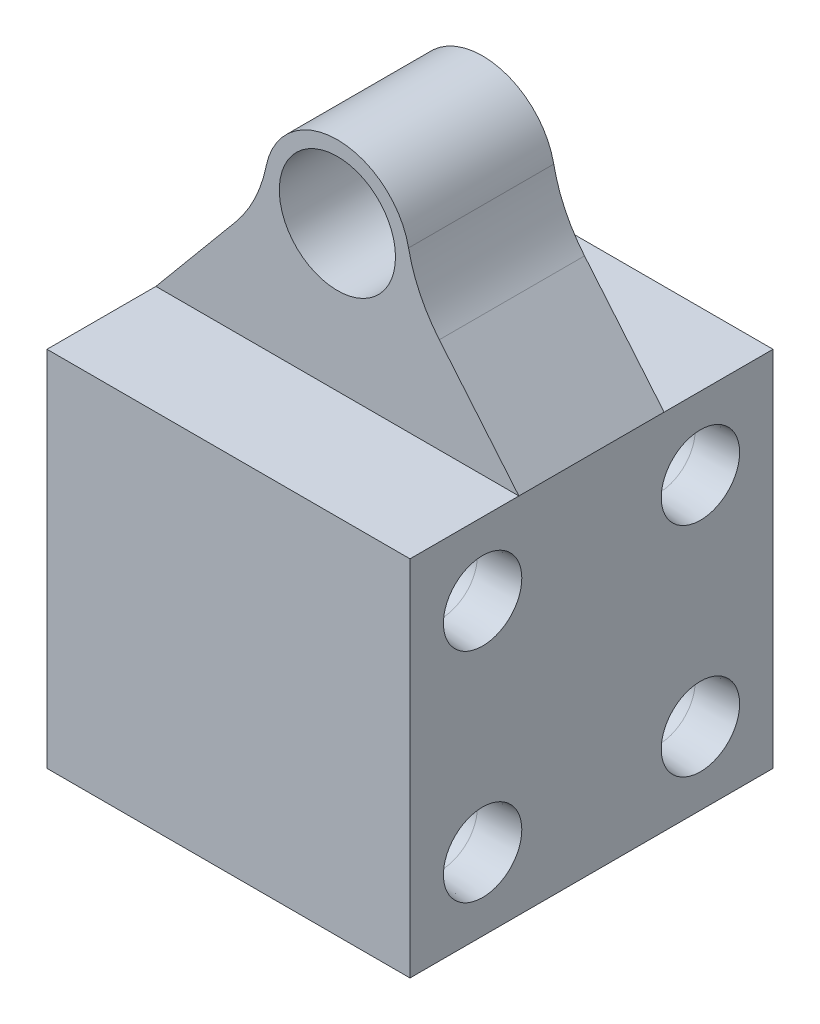
ISO-10303-21;
HEADER;
FILE_DESCRIPTION(('STEP AP214'),'2;1');
FILE_NAME('part.step','',(''),(''),'','','');
FILE_SCHEMA(('AUTOMOTIVE_DESIGN { 1 0 10303 214 1 1 1 1 }'));
ENDSEC;
DATA;
#1=APPLICATION_CONTEXT('core data for automotive mechanical design processes');
#2=APPLICATION_PROTOCOL_DEFINITION('international standard','automotive_design',2000,#1);
#3=PRODUCT_CONTEXT('',#1,'mechanical');
#4=PRODUCT('Part','Part','',(#3));
#5=PRODUCT_RELATED_PRODUCT_CATEGORY('part','',(#4));
#6=PRODUCT_DEFINITION_FORMATION('','',#4);
#7=PRODUCT_DEFINITION_CONTEXT('part definition',#1,'design');
#8=PRODUCT_DEFINITION('design','',#6,#7);
#9=PRODUCT_DEFINITION_SHAPE('','',#8);
#10=(LENGTH_UNIT() NAMED_UNIT(*) SI_UNIT(.MILLI.,.METRE.));
#11=(NAMED_UNIT(*) PLANE_ANGLE_UNIT() SI_UNIT($,.RADIAN.));
#12=(NAMED_UNIT(*) SI_UNIT($,.STERADIAN.) SOLID_ANGLE_UNIT());
#13=UNCERTAINTY_MEASURE_WITH_UNIT(LENGTH_MEASURE(1.E-05),#10,'distance_accuracy_value','');
#14=(GEOMETRIC_REPRESENTATION_CONTEXT(3) GLOBAL_UNCERTAINTY_ASSIGNED_CONTEXT((#13)) GLOBAL_UNIT_ASSIGNED_CONTEXT((#10,
#11,#12)) REPRESENTATION_CONTEXT('',''));
#15=CARTESIAN_POINT('',(0.,0.,0.));
#16=DIRECTION('',(0.,0.,1.));
#17=DIRECTION('',(1.,0.,0.));
#18=AXIS2_PLACEMENT_3D('',#15,#16,#17);
#19=CARTESIAN_POINT('',(0.,25.,0.));
#20=DIRECTION('',(0.,1.,0.));
#21=DIRECTION('',(0.,0.,1.));
#22=AXIS2_PLACEMENT_3D('',#19,#20,#21);
#23=PLANE('',#22);
#24=DIRECTION('',(0.,0.,1.));
#25=VECTOR('',#24,1.);
#26=CARTESIAN_POINT('',(-12.5,25.,-12.5));
#27=LINE('',#26,#25);
#28=CARTESIAN_POINT('',(-12.5,25.,-12.5));
#29=VERTEX_POINT('',#28);
#30=CARTESIAN_POINT('',(-12.5,25.,-5.));
#31=VERTEX_POINT('',#30);
#32=EDGE_CURVE('E248',#29,#31,#27,.T.);
#33=ORIENTED_EDGE('',*,*,#32,.T.);
#34=DIRECTION('',(1.,0.,0.));
#35=VECTOR('',#34,1.);
#36=CARTESIAN_POINT('',(0.,25.,-5.));
#37=LINE('',#36,#35);
#38=CARTESIAN_POINT('',(12.5,25.,-5.));
#39=VERTEX_POINT('',#38);
#40=EDGE_CURVE('E317',#31,#39,#37,.T.);
#41=ORIENTED_EDGE('',*,*,#40,.T.);
#42=DIRECTION('',(0.,0.,-1.));
#43=VECTOR('',#42,1.);
#44=CARTESIAN_POINT('',(12.5,25.,-12.5));
#45=LINE('',#44,#43);
#46=CARTESIAN_POINT('',(12.5,25.,-12.5));
#47=VERTEX_POINT('',#46);
#48=EDGE_CURVE('E267',#39,#47,#45,.T.);
#49=ORIENTED_EDGE('',*,*,#48,.T.);
#50=DIRECTION('',(-1.,0.,0.));
#51=VECTOR('',#50,1.);
#52=CARTESIAN_POINT('',(-12.5,25.,-12.5));
#53=LINE('',#52,#51);
#54=EDGE_CURVE('E249',#47,#29,#53,.T.);
#55=ORIENTED_EDGE('',*,*,#54,.T.);
#56=EDGE_LOOP('',(#33,#41,#49,#55));
#57=FACE_BOUND('',#56,.T.);
#58=ADVANCED_FACE('F107',(#57),#23,.T.);
#59=CARTESIAN_POINT('',(-12.5,5.,7.5));
#60=DIRECTION('',(-1.,0.,0.));
#61=DIRECTION('',(0.,0.,1.));
#62=AXIS2_PLACEMENT_3D('',#59,#60,#61);
#63=CONICAL_SURFACE('',#62,2.7,0.0698131700797731);
#64=CARTESIAN_POINT('',(-9.63986674865748,5.,7.5));
#65=DIRECTION('',(-1.,0.,0.));
#66=DIRECTION('',(0.,0.,1.));
#67=AXIS2_PLACEMENT_3D('',#64,#65,#66);
#68=CIRCLE('',#67,2.49999999999999);
#69=CARTESIAN_POINT('',(-9.63986674865748,5.,9.99999999999999));
#70=VERTEX_POINT('',#69);
#71=EDGE_CURVE('E292',#70,#70,#68,.T.);
#72=ORIENTED_EDGE('',*,*,#71,.F.);
#73=EDGE_LOOP('',(#72));
#74=FACE_BOUND('',#73,.T.);
#75=CARTESIAN_POINT('',(-12.5,5.,7.5));
#76=DIRECTION('',(-1.,0.,0.));
#77=DIRECTION('',(0.,0.,1.));
#78=AXIS2_PLACEMENT_3D('',#75,#76,#77);
#79=CIRCLE('',#78,2.7);
#80=CARTESIAN_POINT('',(-12.5,5.,10.2));
#81=VERTEX_POINT('',#80);
#82=EDGE_CURVE('E286',#81,#81,#79,.T.);
#83=ORIENTED_EDGE('',*,*,#82,.T.);
#84=EDGE_LOOP('',(#83));
#85=FACE_BOUND('',#84,.T.);
#86=ADVANCED_FACE('F405',(#74,#85),#63,.F.);
#87=CARTESIAN_POINT('',(-12.5,5.,7.5));
#88=DIRECTION('',(-1.,0.,0.));
#89=DIRECTION('',(0.,0.,1.));
#90=AXIS2_PLACEMENT_3D('',#87,#88,#89);
#91=CYLINDRICAL_SURFACE('',#90,2.49999999999999);
#92=CARTESIAN_POINT('',(-2.5,5.,7.5));
#93=DIRECTION('',(-1.,0.,0.));
#94=DIRECTION('',(0.,0.,1.));
#95=AXIS2_PLACEMENT_3D('',#92,#93,#94);
#96=CIRCLE('',#95,2.49999999999999);
#97=CARTESIAN_POINT('',(-2.5,5.,9.99999999999999));
#98=VERTEX_POINT('',#97);
#99=EDGE_CURVE('E289',#98,#98,#96,.T.);
#100=ORIENTED_EDGE('',*,*,#99,.F.);
#101=EDGE_LOOP('',(#100));
#102=FACE_BOUND('',#101,.T.);
#103=ORIENTED_EDGE('',*,*,#71,.T.);
#104=EDGE_LOOP('',(#103));
#105=FACE_BOUND('',#104,.T.);
#106=ADVANCED_FACE('F411',(#102,#105),#91,.F.);
#107=CARTESIAN_POINT('',(-2.5,5.,7.5));
#108=DIRECTION('',(-1.,0.,0.));
#109=DIRECTION('',(0.,0.,1.));
#110=AXIS2_PLACEMENT_3D('',#107,#108,#109);
#111=CONICAL_SURFACE('',#110,2.49999999999999,1.02974425867665);
#112=CARTESIAN_POINT('',(-0.997848452431096,5.,7.5));
#113=VERTEX_POINT('',#112);
#114=VERTEX_LOOP('',#113);
#115=FACE_BOUND('',#114,.T.);
#116=ORIENTED_EDGE('',*,*,#99,.T.);
#117=EDGE_LOOP('',(#116));
#118=FACE_BOUND('',#117,.T.);
#119=ADVANCED_FACE('F539',(#115,#118),#111,.F.);
#120=CARTESIAN_POINT('',(-12.5,20.,7.5));
#121=DIRECTION('',(-1.,0.,0.));
#122=DIRECTION('',(0.,0.,1.));
#123=AXIS2_PLACEMENT_3D('',#120,#121,#122);
#124=CONICAL_SURFACE('',#123,2.7,0.0698131700797731);
#125=CARTESIAN_POINT('',(-9.63986674865748,20.,7.5));
#126=DIRECTION('',(-1.,0.,0.));
#127=DIRECTION('',(0.,0.,1.));
#128=AXIS2_PLACEMENT_3D('',#125,#126,#127);
#129=CIRCLE('',#128,2.49999999999999);
#130=CARTESIAN_POINT('',(-9.63986674865748,20.,9.99999999999999));
#131=VERTEX_POINT('',#130);
#132=EDGE_CURVE('E283',#131,#131,#129,.T.);
#133=ORIENTED_EDGE('',*,*,#132,.F.);
#134=EDGE_LOOP('',(#133));
#135=FACE_BOUND('',#134,.T.);
#136=CARTESIAN_POINT('',(-12.5,20.,7.5));
#137=DIRECTION('',(-1.,0.,0.));
#138=DIRECTION('',(0.,0.,1.));
#139=AXIS2_PLACEMENT_3D('',#136,#137,#138);
#140=CIRCLE('',#139,2.7);
#141=CARTESIAN_POINT('',(-12.5,20.,10.2));
#142=VERTEX_POINT('',#141);
#143=EDGE_CURVE('E277',#142,#142,#140,.T.);
#144=ORIENTED_EDGE('',*,*,#143,.T.);
#145=EDGE_LOOP('',(#144));
#146=FACE_BOUND('',#145,.T.);
#147=ADVANCED_FACE('F543',(#135,#146),#124,.F.);
#148=CARTESIAN_POINT('',(-12.5,20.,7.5));
#149=DIRECTION('',(-1.,0.,0.));
#150=DIRECTION('',(0.,0.,1.));
#151=AXIS2_PLACEMENT_3D('',#148,#149,#150);
#152=CYLINDRICAL_SURFACE('',#151,2.49999999999999);
#153=CARTESIAN_POINT('',(-2.5,20.,7.5));
#154=DIRECTION('',(-1.,0.,0.));
#155=DIRECTION('',(0.,0.,1.));
#156=AXIS2_PLACEMENT_3D('',#153,#154,#155);
#157=CIRCLE('',#156,2.49999999999999);
#158=CARTESIAN_POINT('',(-2.5,20.,9.99999999999999));
#159=VERTEX_POINT('',#158);
#160=EDGE_CURVE('E280',#159,#159,#157,.T.);
#161=ORIENTED_EDGE('',*,*,#160,.F.);
#162=EDGE_LOOP('',(#161));
#163=FACE_BOUND('',#162,.T.);
#164=ORIENTED_EDGE('',*,*,#132,.T.);
#165=EDGE_LOOP('',(#164));
#166=FACE_BOUND('',#165,.T.);
#167=ADVANCED_FACE('F547',(#163,#166),#152,.F.);
#168=CARTESIAN_POINT('',(-2.5,20.,7.5));
#169=DIRECTION('',(-1.,0.,0.));
#170=DIRECTION('',(0.,0.,1.));
#171=AXIS2_PLACEMENT_3D('',#168,#169,#170);
#172=CONICAL_SURFACE('',#171,2.49999999999999,1.02974425867665);
#173=CARTESIAN_POINT('',(-0.997848452431096,20.,7.5));
#174=VERTEX_POINT('',#173);
#175=VERTEX_LOOP('',#174);
#176=FACE_BOUND('',#175,.T.);
#177=ORIENTED_EDGE('',*,*,#160,.T.);
#178=EDGE_LOOP('',(#177));
#179=FACE_BOUND('',#178,.T.);
#180=ADVANCED_FACE('F551',(#176,#179),#172,.F.);
#181=CARTESIAN_POINT('',(12.5,25.,-12.5));
#182=DIRECTION('',(-1.,0.,0.));
#183=DIRECTION('',(0.,0.,1.));
#184=AXIS2_PLACEMENT_3D('',#181,#182,#183);
#185=PLANE('',#184);
#186=CARTESIAN_POINT('',(12.5,5.,7.5));
#187=DIRECTION('',(1.,0.,0.));
#188=DIRECTION('',(0.,0.,-1.));
#189=AXIS2_PLACEMENT_3D('',#186,#187,#188);
#190=CIRCLE('',#189,2.7);
#191=CARTESIAN_POINT('',(12.5,5.,4.8));
#192=VERTEX_POINT('',#191);
#193=EDGE_CURVE('E322',#192,#192,#190,.T.);
#194=ORIENTED_EDGE('',*,*,#193,.F.);
#195=EDGE_LOOP('',(#194));
#196=FACE_BOUND('',#195,.T.);
#197=CARTESIAN_POINT('',(12.5,5.,-7.5));
#198=DIRECTION('',(1.,0.,0.));
#199=DIRECTION('',(0.,0.,-1.));
#200=AXIS2_PLACEMENT_3D('',#197,#198,#199);
#201=CIRCLE('',#200,2.7);
#202=CARTESIAN_POINT('',(12.5,5.,-10.2));
#203=VERTEX_POINT('',#202);
#204=EDGE_CURVE('E332',#203,#203,#201,.T.);
#205=ORIENTED_EDGE('',*,*,#204,.F.);
#206=EDGE_LOOP('',(#205));
#207=FACE_BOUND('',#206,.T.);
#208=CARTESIAN_POINT('',(12.5,20.,7.5));
#209=DIRECTION('',(1.,0.,0.));
#210=DIRECTION('',(0.,0.,-1.));
#211=AXIS2_PLACEMENT_3D('',#208,#209,#210);
#212=CIRCLE('',#211,2.7);
#213=CARTESIAN_POINT('',(12.5,20.,4.8));
#214=VERTEX_POINT('',#213);
#215=EDGE_CURVE('E341',#214,#214,#212,.T.);
#216=ORIENTED_EDGE('',*,*,#215,.F.);
#217=EDGE_LOOP('',(#216));
#218=FACE_BOUND('',#217,.T.);
#219=CARTESIAN_POINT('',(12.5,20.,-7.5));
#220=DIRECTION('',(1.,0.,0.));
#221=DIRECTION('',(0.,0.,-1.));
#222=AXIS2_PLACEMENT_3D('',#219,#220,#221);
#223=CIRCLE('',#222,2.7);
#224=CARTESIAN_POINT('',(12.5,20.,-10.2));
#225=VERTEX_POINT('',#224);
#226=EDGE_CURVE('E350',#225,#225,#223,.T.);
#227=ORIENTED_EDGE('',*,*,#226,.F.);
#228=EDGE_LOOP('',(#227));
#229=FACE_BOUND('',#228,.T.);
#230=DIRECTION('',(0.,0.,-1.));
#231=VECTOR('',#230,1.);
#232=CARTESIAN_POINT('',(12.5,0.,-12.5));
#233=LINE('',#232,#231);
#234=CARTESIAN_POINT('',(12.5,0.,12.5));
#235=VERTEX_POINT('',#234);
#236=CARTESIAN_POINT('',(12.5,0.,-12.5));
#237=VERTEX_POINT('',#236);
#238=EDGE_CURVE('E257',#235,#237,#233,.T.);
#239=ORIENTED_EDGE('',*,*,#238,.T.);
#240=DIRECTION('',(0.,-1.,0.));
#241=VECTOR('',#240,1.);
#242=CARTESIAN_POINT('',(12.5,25.,-12.5));
#243=LINE('',#242,#241);
#244=EDGE_CURVE('E274',#47,#237,#243,.T.);
#245=ORIENTED_EDGE('',*,*,#244,.F.);
#246=ORIENTED_EDGE('',*,*,#48,.F.);
#247=DIRECTION('',(0.,0.,1.));
#248=VECTOR('',#247,1.);
#249=CARTESIAN_POINT('',(12.5,25.,-5.));
#250=LINE('',#249,#248);
#251=CARTESIAN_POINT('',(12.5,25.,5.));
#252=VERTEX_POINT('',#251);
#253=EDGE_CURVE('E231',#39,#252,#250,.T.);
#254=ORIENTED_EDGE('',*,*,#253,.T.);
#255=CARTESIAN_POINT('',(12.5,25.,12.5));
#256=VERTEX_POINT('',#255);
#257=EDGE_CURVE('E240',#256,#252,#45,.T.);
#258=ORIENTED_EDGE('',*,*,#257,.F.);
#259=DIRECTION('',(0.,-1.,0.));
#260=VECTOR('',#259,1.);
#261=CARTESIAN_POINT('',(12.5,25.,12.5));
#262=LINE('',#261,#260);
#263=EDGE_CURVE('E256',#256,#235,#262,.T.);
#264=ORIENTED_EDGE('',*,*,#263,.T.);
#265=EDGE_LOOP('',(#239,#245,#246,#254,#258,#264));
#266=FACE_BOUND('',#265,.T.);
#267=ADVANCED_FACE('F383',(#196,#207,#218,#229,#266),#185,.F.);
#268=CARTESIAN_POINT('',(-12.5,25.,-12.5));
#269=DIRECTION('',(0.,0.,1.));
#270=DIRECTION('',(1.,0.,0.));
#271=AXIS2_PLACEMENT_3D('',#268,#269,#270);
#272=PLANE('',#271);
#273=DIRECTION('',(-1.,0.,0.));
#274=VECTOR('',#273,1.);
#275=CARTESIAN_POINT('',(-12.5,0.,-12.5));
#276=LINE('',#275,#274);
#277=CARTESIAN_POINT('',(-12.5,0.,-12.5));
#278=VERTEX_POINT('',#277);
#279=EDGE_CURVE('E260',#237,#278,#276,.T.);
#280=ORIENTED_EDGE('',*,*,#279,.T.);
#281=DIRECTION('',(0.,-1.,0.));
#282=VECTOR('',#281,1.);
#283=CARTESIAN_POINT('',(-12.5,25.,-12.5));
#284=LINE('',#283,#282);
#285=EDGE_CURVE('E271',#29,#278,#284,.T.);
#286=ORIENTED_EDGE('',*,*,#285,.F.);
#287=ORIENTED_EDGE('',*,*,#54,.F.);
#288=ORIENTED_EDGE('',*,*,#244,.T.);
#289=EDGE_LOOP('',(#280,#286,#287,#288));
#290=FACE_BOUND('',#289,.T.);
#291=ADVANCED_FACE('F382',(#290),#272,.F.);
#292=CARTESIAN_POINT('',(-12.5,25.,-12.5));
#293=DIRECTION('',(1.,0.,0.));
#294=DIRECTION('',(0.,0.,-1.));
#295=AXIS2_PLACEMENT_3D('',#292,#293,#294);
#296=PLANE('',#295);
#297=CARTESIAN_POINT('',(-12.5,5.,-7.5));
#298=DIRECTION('',(-1.,0.,0.));
#299=DIRECTION('',(0.,0.,1.));
#300=AXIS2_PLACEMENT_3D('',#297,#298,#299);
#301=CIRCLE('',#300,2.7);
#302=CARTESIAN_POINT('',(-12.5,5.,-4.8));
#303=VERTEX_POINT('',#302);
#304=EDGE_CURVE('E359',#303,#303,#301,.T.);
#305=ORIENTED_EDGE('',*,*,#304,.F.);
#306=EDGE_LOOP('',(#305));
#307=FACE_BOUND('',#306,.T.);
#308=CARTESIAN_POINT('',(-12.5,20.,-7.5));
#309=DIRECTION('',(-1.,0.,0.));
#310=DIRECTION('',(0.,0.,1.));
#311=AXIS2_PLACEMENT_3D('',#308,#309,#310);
#312=CIRCLE('',#311,2.7);
#313=CARTESIAN_POINT('',(-12.5,20.,-4.8));
#314=VERTEX_POINT('',#313);
#315=EDGE_CURVE('E368',#314,#314,#312,.T.);
#316=ORIENTED_EDGE('',*,*,#315,.F.);
#317=EDGE_LOOP('',(#316));
#318=FACE_BOUND('',#317,.T.);
#319=DIRECTION('',(0.,0.,1.));
#320=VECTOR('',#319,1.);
#321=CARTESIAN_POINT('',(-12.5,0.,-12.5));
#322=LINE('',#321,#320);
#323=CARTESIAN_POINT('',(-12.5,0.,12.5));
#324=VERTEX_POINT('',#323);
#325=EDGE_CURVE('E263',#278,#324,#322,.T.);
#326=ORIENTED_EDGE('',*,*,#325,.T.);
#327=DIRECTION('',(0.,-1.,0.));
#328=VECTOR('',#327,1.);
#329=CARTESIAN_POINT('',(-12.5,25.,12.5));
#330=LINE('',#329,#328);
#331=CARTESIAN_POINT('',(-12.5,25.,12.5));
#332=VERTEX_POINT('',#331);
#333=EDGE_CURVE('E246',#332,#324,#330,.T.);
#334=ORIENTED_EDGE('',*,*,#333,.F.);
#335=CARTESIAN_POINT('',(-12.5,25.,5.));
#336=VERTEX_POINT('',#335);
#337=EDGE_CURVE('E237',#336,#332,#27,.T.);
#338=ORIENTED_EDGE('',*,*,#337,.F.);
#339=DIRECTION('',(0.,0.,1.));
#340=VECTOR('',#339,1.);
#341=CARTESIAN_POINT('',(-12.5,25.,-5.));
#342=LINE('',#341,#340);
#343=EDGE_CURVE('E222',#31,#336,#342,.T.);
#344=ORIENTED_EDGE('',*,*,#343,.F.);
#345=ORIENTED_EDGE('',*,*,#32,.F.);
#346=ORIENTED_EDGE('',*,*,#285,.T.);
#347=EDGE_LOOP('',(#326,#334,#338,#344,#345,#346));
#348=FACE_BOUND('',#347,.T.);
#349=ORIENTED_EDGE('',*,*,#143,.F.);
#350=EDGE_LOOP('',(#349));
#351=FACE_BOUND('',#350,.T.);
#352=ORIENTED_EDGE('',*,*,#82,.F.);
#353=EDGE_LOOP('',(#352));
#354=FACE_BOUND('',#353,.T.);
#355=ADVANCED_FACE('F243',(#307,#318,#348,#351,#354),#296,.F.);
#356=CARTESIAN_POINT('',(-12.5,25.,12.5));
#357=DIRECTION('',(0.,0.,-1.));
#358=DIRECTION('',(-1.,0.,0.));
#359=AXIS2_PLACEMENT_3D('',#356,#357,#358);
#360=PLANE('',#359);
#361=DIRECTION('',(1.,0.,0.));
#362=VECTOR('',#361,1.);
#363=CARTESIAN_POINT('',(-12.5,0.,12.5));
#364=LINE('',#363,#362);
#365=EDGE_CURVE('E265',#324,#235,#364,.T.);
#366=ORIENTED_EDGE('',*,*,#365,.T.);
#367=ORIENTED_EDGE('',*,*,#263,.F.);
#368=DIRECTION('',(1.,0.,0.));
#369=VECTOR('',#368,1.);
#370=CARTESIAN_POINT('',(-12.5,25.,12.5));
#371=LINE('',#370,#369);
#372=EDGE_CURVE('E251',#332,#256,#371,.T.);
#373=ORIENTED_EDGE('',*,*,#372,.F.);
#374=ORIENTED_EDGE('',*,*,#333,.T.);
#375=EDGE_LOOP('',(#366,#367,#373,#374));
#376=FACE_BOUND('',#375,.T.);
#377=ADVANCED_FACE('F391',(#376),#360,.F.);
#378=DIRECTION('',(1.,0.,0.));
#379=VECTOR('',#378,1.);
#380=CARTESIAN_POINT('',(0.,25.,5.));
#381=LINE('',#380,#379);
#382=EDGE_CURVE('E213',#336,#252,#381,.T.);
#383=ORIENTED_EDGE('',*,*,#382,.F.);
#384=ORIENTED_EDGE('',*,*,#337,.T.);
#385=ORIENTED_EDGE('',*,*,#372,.T.);
#386=ORIENTED_EDGE('',*,*,#257,.T.);
#387=EDGE_LOOP('',(#383,#384,#385,#386));
#388=FACE_BOUND('',#387,.T.);
#389=ADVANCED_FACE('F236',(#388),#23,.T.);
#390=CARTESIAN_POINT('',(0.,0.,0.));
#391=DIRECTION('',(0.,1.,0.));
#392=DIRECTION('',(0.,0.,1.));
#393=AXIS2_PLACEMENT_3D('',#390,#391,#392);
#394=PLANE('',#393);
#395=ORIENTED_EDGE('',*,*,#238,.F.);
#396=ORIENTED_EDGE('',*,*,#365,.F.);
#397=ORIENTED_EDGE('',*,*,#325,.F.);
#398=ORIENTED_EDGE('',*,*,#279,.F.);
#399=EDGE_LOOP('',(#395,#396,#397,#398));
#400=FACE_BOUND('',#399,.T.);
#401=ADVANCED_FACE('F388',(#400),#394,.F.);
#402=CARTESIAN_POINT('',(-2.50000000000001,20.,-7.5));
#403=DIRECTION('',(-1.,0.,0.));
#404=DIRECTION('',(0.,0.,1.));
#405=AXIS2_PLACEMENT_3D('',#402,#403,#404);
#406=CONICAL_SURFACE('',#405,2.49999999999999,1.02974425867665);
#407=CARTESIAN_POINT('',(-0.997848452431099,20.,-7.5));
#408=VERTEX_POINT('',#407);
#409=VERTEX_LOOP('',#408);
#410=FACE_BOUND('',#409,.T.);
#411=CARTESIAN_POINT('',(-2.50000000000001,20.,-7.5));
#412=DIRECTION('',(-1.,0.,0.));
#413=DIRECTION('',(0.,0.,1.));
#414=AXIS2_PLACEMENT_3D('',#411,#412,#413);
#415=CIRCLE('',#414,2.49999999999999);
#416=CARTESIAN_POINT('',(-2.50000000000001,20.,-5.00000000000001));
#417=VERTEX_POINT('',#416);
#418=EDGE_CURVE('E261',#417,#417,#415,.T.);
#419=ORIENTED_EDGE('',*,*,#418,.T.);
#420=EDGE_LOOP('',(#419));
#421=FACE_BOUND('',#420,.T.);
#422=ADVANCED_FACE('F415',(#410,#421),#406,.F.);
#423=CARTESIAN_POINT('',(-12.5,20.,-7.5));
#424=DIRECTION('',(-1.,0.,0.));
#425=DIRECTION('',(0.,0.,1.));
#426=AXIS2_PLACEMENT_3D('',#423,#424,#425);
#427=CYLINDRICAL_SURFACE('',#426,2.49999999999999);
#428=ORIENTED_EDGE('',*,*,#418,.F.);
#429=EDGE_LOOP('',(#428));
#430=FACE_BOUND('',#429,.T.);
#431=CARTESIAN_POINT('',(-9.63986674865748,20.,-7.5));
#432=DIRECTION('',(-1.,0.,0.));
#433=DIRECTION('',(0.,0.,1.));
#434=AXIS2_PLACEMENT_3D('',#431,#432,#433);
#435=CIRCLE('',#434,2.49999999999999);
#436=CARTESIAN_POINT('',(-9.63986674865748,20.,-5.00000000000001));
#437=VERTEX_POINT('',#436);
#438=EDGE_CURVE('E371',#437,#437,#435,.T.);
#439=ORIENTED_EDGE('',*,*,#438,.T.);
#440=EDGE_LOOP('',(#439));
#441=FACE_BOUND('',#440,.T.);
#442=ADVANCED_FACE('F421',(#430,#441),#427,.F.);
#443=CARTESIAN_POINT('',(-12.5,20.,-7.5));
#444=DIRECTION('',(-1.,0.,0.));
#445=DIRECTION('',(0.,0.,1.));
#446=AXIS2_PLACEMENT_3D('',#443,#444,#445);
#447=CONICAL_SURFACE('',#446,2.7,0.0698131700797731);
#448=ORIENTED_EDGE('',*,*,#438,.F.);
#449=EDGE_LOOP('',(#448));
#450=FACE_BOUND('',#449,.T.);
#451=ORIENTED_EDGE('',*,*,#315,.T.);
#452=EDGE_LOOP('',(#451));
#453=FACE_BOUND('',#452,.T.);
#454=ADVANCED_FACE('F426',(#450,#453),#447,.F.);
#455=CARTESIAN_POINT('',(-2.50000000000001,5.,-7.5));
#456=DIRECTION('',(-1.,0.,0.));
#457=DIRECTION('',(0.,0.,1.));
#458=AXIS2_PLACEMENT_3D('',#455,#456,#457);
#459=CONICAL_SURFACE('',#458,2.49999999999999,1.02974425867665);
#460=CARTESIAN_POINT('',(-0.997848452431099,5.,-7.5));
#461=VERTEX_POINT('',#460);
#462=VERTEX_LOOP('',#461);
#463=FACE_BOUND('',#462,.T.);
#464=CARTESIAN_POINT('',(-2.50000000000001,5.,-7.5));
#465=DIRECTION('',(-1.,0.,0.));
#466=DIRECTION('',(0.,0.,1.));
#467=AXIS2_PLACEMENT_3D('',#464,#465,#466);
#468=CIRCLE('',#467,2.49999999999999);
#469=CARTESIAN_POINT('',(-2.50000000000001,5.,-5.00000000000001));
#470=VERTEX_POINT('',#469);
#471=EDGE_CURVE('E365',#470,#470,#468,.T.);
#472=ORIENTED_EDGE('',*,*,#471,.T.);
#473=EDGE_LOOP('',(#472));
#474=FACE_BOUND('',#473,.T.);
#475=ADVANCED_FACE('F435',(#463,#474),#459,.F.);
#476=CARTESIAN_POINT('',(-12.5,5.,-7.5));
#477=DIRECTION('',(-1.,0.,0.));
#478=DIRECTION('',(0.,0.,1.));
#479=AXIS2_PLACEMENT_3D('',#476,#477,#478);
#480=CYLINDRICAL_SURFACE('',#479,2.49999999999999);
#481=ORIENTED_EDGE('',*,*,#471,.F.);
#482=EDGE_LOOP('',(#481));
#483=FACE_BOUND('',#482,.T.);
#484=CARTESIAN_POINT('',(-9.63986674865748,5.,-7.5));
#485=DIRECTION('',(-1.,0.,0.));
#486=DIRECTION('',(0.,0.,1.));
#487=AXIS2_PLACEMENT_3D('',#484,#485,#486);
#488=CIRCLE('',#487,2.49999999999999);
#489=CARTESIAN_POINT('',(-9.63986674865748,5.,-5.00000000000001));
#490=VERTEX_POINT('',#489);
#491=EDGE_CURVE('E362',#490,#490,#488,.T.);
#492=ORIENTED_EDGE('',*,*,#491,.T.);
#493=EDGE_LOOP('',(#492));
#494=FACE_BOUND('',#493,.T.);
#495=ADVANCED_FACE('F442',(#483,#494),#480,.F.);
#496=CARTESIAN_POINT('',(-12.5,5.,-7.5));
#497=DIRECTION('',(-1.,0.,0.));
#498=DIRECTION('',(0.,0.,1.));
#499=AXIS2_PLACEMENT_3D('',#496,#497,#498);
#500=CONICAL_SURFACE('',#499,2.7,0.0698131700797731);
#501=ORIENTED_EDGE('',*,*,#491,.F.);
#502=EDGE_LOOP('',(#501));
#503=FACE_BOUND('',#502,.T.);
#504=ORIENTED_EDGE('',*,*,#304,.T.);
#505=EDGE_LOOP('',(#504));
#506=FACE_BOUND('',#505,.T.);
#507=ADVANCED_FACE('F448',(#503,#506),#500,.F.);
#508=CARTESIAN_POINT('',(2.50000000000001,20.,-7.5));
#509=DIRECTION('',(1.,0.,0.));
#510=DIRECTION('',(0.,0.,-1.));
#511=AXIS2_PLACEMENT_3D('',#508,#509,#510);
#512=CONICAL_SURFACE('',#511,2.49999999999999,1.02974425867665);
#513=CARTESIAN_POINT('',(0.997848452431099,20.,-7.5));
#514=VERTEX_POINT('',#513);
#515=VERTEX_LOOP('',#514);
#516=FACE_BOUND('',#515,.T.);
#517=CARTESIAN_POINT('',(2.50000000000001,20.,-7.5));
#518=DIRECTION('',(1.,0.,0.));
#519=DIRECTION('',(0.,0.,-1.));
#520=AXIS2_PLACEMENT_3D('',#517,#518,#519);
#521=CIRCLE('',#520,2.49999999999999);
#522=CARTESIAN_POINT('',(2.50000000000001,20.,-9.99999999999999));
#523=VERTEX_POINT('',#522);
#524=EDGE_CURVE('E356',#523,#523,#521,.T.);
#525=ORIENTED_EDGE('',*,*,#524,.T.);
#526=EDGE_LOOP('',(#525));
#527=FACE_BOUND('',#526,.T.);
#528=ADVANCED_FACE('F452',(#516,#527),#512,.F.);
#529=CARTESIAN_POINT('',(12.5,20.,-7.5));
#530=DIRECTION('',(1.,0.,0.));
#531=DIRECTION('',(0.,0.,-1.));
#532=AXIS2_PLACEMENT_3D('',#529,#530,#531);
#533=CYLINDRICAL_SURFACE('',#532,2.49999999999999);
#534=ORIENTED_EDGE('',*,*,#524,.F.);
#535=EDGE_LOOP('',(#534));
#536=FACE_BOUND('',#535,.T.);
#537=CARTESIAN_POINT('',(9.63986674865748,20.,-7.5));
#538=DIRECTION('',(1.,0.,0.));
#539=DIRECTION('',(0.,0.,-1.));
#540=AXIS2_PLACEMENT_3D('',#537,#538,#539);
#541=CIRCLE('',#540,2.49999999999999);
#542=CARTESIAN_POINT('',(9.63986674865748,20.,-9.99999999999999));
#543=VERTEX_POINT('',#542);
#544=EDGE_CURVE('E353',#543,#543,#541,.T.);
#545=ORIENTED_EDGE('',*,*,#544,.T.);
#546=EDGE_LOOP('',(#545));
#547=FACE_BOUND('',#546,.T.);
#548=ADVANCED_FACE('F456',(#536,#547),#533,.F.);
#549=CARTESIAN_POINT('',(12.5,20.,-7.5));
#550=DIRECTION('',(1.,0.,0.));
#551=DIRECTION('',(0.,0.,-1.));
#552=AXIS2_PLACEMENT_3D('',#549,#550,#551);
#553=CONICAL_SURFACE('',#552,2.7,0.0698131700797731);
#554=ORIENTED_EDGE('',*,*,#544,.F.);
#555=EDGE_LOOP('',(#554));
#556=FACE_BOUND('',#555,.T.);
#557=ORIENTED_EDGE('',*,*,#226,.T.);
#558=EDGE_LOOP('',(#557));
#559=FACE_BOUND('',#558,.T.);
#560=ADVANCED_FACE('F460',(#556,#559),#553,.F.);
#561=CARTESIAN_POINT('',(2.5,20.,7.5));
#562=DIRECTION('',(1.,0.,0.));
#563=DIRECTION('',(0.,0.,-1.));
#564=AXIS2_PLACEMENT_3D('',#561,#562,#563);
#565=CONICAL_SURFACE('',#564,2.49999999999999,1.02974425867665);
#566=CARTESIAN_POINT('',(0.997848452431097,20.,7.5));
#567=VERTEX_POINT('',#566);
#568=VERTEX_LOOP('',#567);
#569=FACE_BOUND('',#568,.T.);
#570=CARTESIAN_POINT('',(2.5,20.,7.5));
#571=DIRECTION('',(1.,0.,0.));
#572=DIRECTION('',(0.,0.,-1.));
#573=AXIS2_PLACEMENT_3D('',#570,#571,#572);
#574=CIRCLE('',#573,2.49999999999999);
#575=CARTESIAN_POINT('',(2.5,20.,5.00000000000001));
#576=VERTEX_POINT('',#575);
#577=EDGE_CURVE('E347',#576,#576,#574,.T.);
#578=ORIENTED_EDGE('',*,*,#577,.T.);
#579=EDGE_LOOP('',(#578));
#580=FACE_BOUND('',#579,.T.);
#581=ADVANCED_FACE('F464',(#569,#580),#565,.F.);
#582=CARTESIAN_POINT('',(12.5,20.,7.5));
#583=DIRECTION('',(1.,0.,0.));
#584=DIRECTION('',(0.,0.,-1.));
#585=AXIS2_PLACEMENT_3D('',#582,#583,#584);
#586=CYLINDRICAL_SURFACE('',#585,2.49999999999999);
#587=ORIENTED_EDGE('',*,*,#577,.F.);
#588=EDGE_LOOP('',(#587));
#589=FACE_BOUND('',#588,.T.);
#590=CARTESIAN_POINT('',(9.63986674865748,20.,7.5));
#591=DIRECTION('',(1.,0.,0.));
#592=DIRECTION('',(0.,0.,-1.));
#593=AXIS2_PLACEMENT_3D('',#590,#591,#592);
#594=CIRCLE('',#593,2.49999999999999);
#595=CARTESIAN_POINT('',(9.63986674865748,20.,5.00000000000001));
#596=VERTEX_POINT('',#595);
#597=EDGE_CURVE('E344',#596,#596,#594,.T.);
#598=ORIENTED_EDGE('',*,*,#597,.T.);
#599=EDGE_LOOP('',(#598));
#600=FACE_BOUND('',#599,.T.);
#601=ADVANCED_FACE('F468',(#589,#600),#586,.F.);
#602=CARTESIAN_POINT('',(12.5,20.,7.5));
#603=DIRECTION('',(1.,0.,0.));
#604=DIRECTION('',(0.,0.,-1.));
#605=AXIS2_PLACEMENT_3D('',#602,#603,#604);
#606=CONICAL_SURFACE('',#605,2.7,0.0698131700797731);
#607=ORIENTED_EDGE('',*,*,#597,.F.);
#608=EDGE_LOOP('',(#607));
#609=FACE_BOUND('',#608,.T.);
#610=ORIENTED_EDGE('',*,*,#215,.T.);
#611=EDGE_LOOP('',(#610));
#612=FACE_BOUND('',#611,.T.);
#613=ADVANCED_FACE('F472',(#609,#612),#606,.F.);
#614=CARTESIAN_POINT('',(2.50000000000001,5.,-7.5));
#615=DIRECTION('',(1.,0.,0.));
#616=DIRECTION('',(0.,0.,-1.));
#617=AXIS2_PLACEMENT_3D('',#614,#615,#616);
#618=CONICAL_SURFACE('',#617,2.49999999999999,1.02974425867665);
#619=CARTESIAN_POINT('',(0.997848452431099,5.,-7.5));
#620=VERTEX_POINT('',#619);
#621=VERTEX_LOOP('',#620);
#622=FACE_BOUND('',#621,.T.);
#623=CARTESIAN_POINT('',(2.50000000000001,5.,-7.5));
#624=DIRECTION('',(1.,0.,0.));
#625=DIRECTION('',(0.,0.,-1.));
#626=AXIS2_PLACEMENT_3D('',#623,#624,#625);
#627=CIRCLE('',#626,2.49999999999999);
#628=CARTESIAN_POINT('',(2.50000000000001,5.,-9.99999999999999));
#629=VERTEX_POINT('',#628);
#630=EDGE_CURVE('E338',#629,#629,#627,.T.);
#631=ORIENTED_EDGE('',*,*,#630,.T.);
#632=EDGE_LOOP('',(#631));
#633=FACE_BOUND('',#632,.T.);
#634=ADVANCED_FACE('F476',(#622,#633),#618,.F.);
#635=CARTESIAN_POINT('',(12.5,5.,-7.5));
#636=DIRECTION('',(1.,0.,0.));
#637=DIRECTION('',(0.,0.,-1.));
#638=AXIS2_PLACEMENT_3D('',#635,#636,#637);
#639=CYLINDRICAL_SURFACE('',#638,2.49999999999999);
#640=ORIENTED_EDGE('',*,*,#630,.F.);
#641=EDGE_LOOP('',(#640));
#642=FACE_BOUND('',#641,.T.);
#643=CARTESIAN_POINT('',(9.63986674865748,5.,-7.5));
#644=DIRECTION('',(1.,0.,0.));
#645=DIRECTION('',(0.,0.,-1.));
#646=AXIS2_PLACEMENT_3D('',#643,#644,#645);
#647=CIRCLE('',#646,2.49999999999999);
#648=CARTESIAN_POINT('',(9.63986674865748,5.,-9.99999999999999));
#649=VERTEX_POINT('',#648);
#650=EDGE_CURVE('E335',#649,#649,#647,.T.);
#651=ORIENTED_EDGE('',*,*,#650,.T.);
#652=EDGE_LOOP('',(#651));
#653=FACE_BOUND('',#652,.T.);
#654=ADVANCED_FACE('F480',(#642,#653),#639,.F.);
#655=CARTESIAN_POINT('',(12.5,5.,-7.5));
#656=DIRECTION('',(1.,0.,0.));
#657=DIRECTION('',(0.,0.,-1.));
#658=AXIS2_PLACEMENT_3D('',#655,#656,#657);
#659=CONICAL_SURFACE('',#658,2.7,0.0698131700797738);
#660=ORIENTED_EDGE('',*,*,#650,.F.);
#661=EDGE_LOOP('',(#660));
#662=FACE_BOUND('',#661,.T.);
#663=ORIENTED_EDGE('',*,*,#204,.T.);
#664=EDGE_LOOP('',(#663));
#665=FACE_BOUND('',#664,.T.);
#666=ADVANCED_FACE('F484',(#662,#665),#659,.F.);
#667=CARTESIAN_POINT('',(2.5,5.,7.5));
#668=DIRECTION('',(1.,0.,0.));
#669=DIRECTION('',(0.,0.,-1.));
#670=AXIS2_PLACEMENT_3D('',#667,#668,#669);
#671=CONICAL_SURFACE('',#670,2.49999999999999,1.02974425867665);
#672=CARTESIAN_POINT('',(0.997848452431097,5.,7.5));
#673=VERTEX_POINT('',#672);
#674=VERTEX_LOOP('',#673);
#675=FACE_BOUND('',#674,.T.);
#676=CARTESIAN_POINT('',(2.5,5.,7.5));
#677=DIRECTION('',(1.,0.,0.));
#678=DIRECTION('',(0.,0.,-1.));
#679=AXIS2_PLACEMENT_3D('',#676,#677,#678);
#680=CIRCLE('',#679,2.49999999999999);
#681=CARTESIAN_POINT('',(2.5,5.,5.00000000000001));
#682=VERTEX_POINT('',#681);
#683=EDGE_CURVE('E329',#682,#682,#680,.T.);
#684=ORIENTED_EDGE('',*,*,#683,.T.);
#685=EDGE_LOOP('',(#684));
#686=FACE_BOUND('',#685,.T.);
#687=ADVANCED_FACE('F488',(#675,#686),#671,.F.);
#688=CARTESIAN_POINT('',(12.5,5.,7.5));
#689=DIRECTION('',(1.,0.,0.));
#690=DIRECTION('',(0.,0.,-1.));
#691=AXIS2_PLACEMENT_3D('',#688,#689,#690);
#692=CYLINDRICAL_SURFACE('',#691,2.49999999999999);
#693=ORIENTED_EDGE('',*,*,#683,.F.);
#694=EDGE_LOOP('',(#693));
#695=FACE_BOUND('',#694,.T.);
#696=CARTESIAN_POINT('',(9.63986674865748,5.,7.5));
#697=DIRECTION('',(1.,0.,0.));
#698=DIRECTION('',(0.,0.,-1.));
#699=AXIS2_PLACEMENT_3D('',#696,#697,#698);
#700=CIRCLE('',#699,2.49999999999999);
#701=CARTESIAN_POINT('',(9.63986674865748,5.,5.00000000000001));
#702=VERTEX_POINT('',#701);
#703=EDGE_CURVE('E326',#702,#702,#700,.T.);
#704=ORIENTED_EDGE('',*,*,#703,.T.);
#705=EDGE_LOOP('',(#704));
#706=FACE_BOUND('',#705,.T.);
#707=ADVANCED_FACE('F492',(#695,#706),#692,.F.);
#708=CARTESIAN_POINT('',(12.5,5.,7.5));
#709=DIRECTION('',(1.,0.,0.));
#710=DIRECTION('',(0.,0.,-1.));
#711=AXIS2_PLACEMENT_3D('',#708,#709,#710);
#712=CONICAL_SURFACE('',#711,2.7,0.0698131700797738);
#713=ORIENTED_EDGE('',*,*,#703,.F.);
#714=EDGE_LOOP('',(#713));
#715=FACE_BOUND('',#714,.T.);
#716=ORIENTED_EDGE('',*,*,#193,.T.);
#717=EDGE_LOOP('',(#716));
#718=FACE_BOUND('',#717,.T.);
#719=ADVANCED_FACE('F496',(#715,#718),#712,.F.);
#720=CARTESIAN_POINT('',(0.,35.,5.));
#721=DIRECTION('',(0.,0.,-1.));
#722=DIRECTION('',(-1.,0.,0.));
#723=AXIS2_PLACEMENT_3D('',#720,#721,#722);
#724=CYLINDRICAL_SURFACE('',#723,5.);
#725=CARTESIAN_POINT('',(0.,35.,-5.));
#726=DIRECTION('',(0.,0.,1.));
#727=DIRECTION('',(1.,0.,0.));
#728=AXIS2_PLACEMENT_3D('',#725,#726,#727);
#729=CIRCLE('',#728,5.);
#730=CARTESIAN_POINT('',(4.90039886063564,35.993021151175,-5.));
#731=VERTEX_POINT('',#730);
#732=CARTESIAN_POINT('',(-4.90039886063564,35.993021151175,-5.));
#733=VERTEX_POINT('',#732);
#734=EDGE_CURVE('E525',#731,#733,#729,.T.);
#735=ORIENTED_EDGE('',*,*,#734,.T.);
#736=DIRECTION('',(0.,0.,-1.));
#737=VECTOR('',#736,1.);
#738=CARTESIAN_POINT('',(-4.90039886063564,35.993021151175,5.));
#739=LINE('',#738,#737);
#740=CARTESIAN_POINT('',(-4.90039886063564,35.993021151175,5.));
#741=VERTEX_POINT('',#740);
#742=EDGE_CURVE('E297',#733,#741,#739,.F.);
#743=ORIENTED_EDGE('',*,*,#742,.T.);
#744=CARTESIAN_POINT('',(0.,35.,5.));
#745=DIRECTION('',(0.,0.,1.));
#746=DIRECTION('',(1.,0.,0.));
#747=AXIS2_PLACEMENT_3D('',#744,#745,#746);
#748=CIRCLE('',#747,5.);
#749=CARTESIAN_POINT('',(4.90039886063564,35.993021151175,5.));
#750=VERTEX_POINT('',#749);
#751=EDGE_CURVE('E219',#750,#741,#748,.T.);
#752=ORIENTED_EDGE('',*,*,#751,.F.);
#753=DIRECTION('',(0.,0.,-1.));
#754=VECTOR('',#753,1.);
#755=CARTESIAN_POINT('',(4.90039886063564,35.993021151175,5.));
#756=LINE('',#755,#754);
#757=EDGE_CURVE('E295',#750,#731,#756,.T.);
#758=ORIENTED_EDGE('',*,*,#757,.T.);
#759=EDGE_LOOP('',(#735,#743,#752,#758));
#760=FACE_BOUND('',#759,.T.);
#761=ADVANCED_FACE('F309',(#760),#724,.T.);
#762=CARTESIAN_POINT('',(0.,0.,5.));
#763=DIRECTION('',(0.,0.,1.));
#764=DIRECTION('',(1.,0.,0.));
#765=AXIS2_PLACEMENT_3D('',#762,#763,#764);
#766=PLANE('',#765);
#767=DIRECTION('',(0.64018439966448,-0.768221279597376,0.));
#768=VECTOR('',#767,1.);
#769=CARTESIAN_POINT('',(19.672131147541,16.3934426229508,5.));
#770=LINE('',#769,#768);
#771=CARTESIAN_POINT('',(7.01898378593315,31.5772194568802,5.));
#772=VERTEX_POINT('',#771);
#773=EDGE_CURVE('E241',#772,#252,#770,.T.);
#774=ORIENTED_EDGE('',*,*,#773,.F.);
#775=CARTESIAN_POINT('',(14.7011965819069,37.979063453525,5.));
#776=DIRECTION('',(0.,0.,1.));
#777=DIRECTION('',(1.,0.,0.));
#778=AXIS2_PLACEMENT_3D('',#775,#776,#777);
#779=CIRCLE('',#778,10.);
#780=EDGE_CURVE('E115',#772,#750,#779,.F.);
#781=ORIENTED_EDGE('',*,*,#780,.T.);
#782=ORIENTED_EDGE('',*,*,#751,.T.);
#783=CARTESIAN_POINT('',(-14.7011965819069,37.979063453525,5.));
#784=DIRECTION('',(0.,0.,1.));
#785=DIRECTION('',(1.,0.,0.));
#786=AXIS2_PLACEMENT_3D('',#783,#784,#785);
#787=CIRCLE('',#786,10.);
#788=CARTESIAN_POINT('',(-7.01898378593316,31.5772194568802,5.));
#789=VERTEX_POINT('',#788);
#790=EDGE_CURVE('E216',#741,#789,#787,.F.);
#791=ORIENTED_EDGE('',*,*,#790,.T.);
#792=DIRECTION('',(-0.64018439966448,-0.768221279597376,0.));
#793=VECTOR('',#792,1.);
#794=CARTESIAN_POINT('',(-19.672131147541,16.3934426229508,5.));
#795=LINE('',#794,#793);
#796=EDGE_CURVE('E207',#789,#336,#795,.T.);
#797=ORIENTED_EDGE('',*,*,#796,.T.);
#798=ORIENTED_EDGE('',*,*,#382,.T.);
#799=EDGE_LOOP('',(#774,#781,#782,#791,#797,#798));
#800=FACE_BOUND('',#799,.T.);
#801=CARTESIAN_POINT('',(0.,35.,5.));
#802=DIRECTION('',(0.,0.,1.));
#803=DIRECTION('',(1.,0.,0.));
#804=AXIS2_PLACEMENT_3D('',#801,#802,#803);
#805=CIRCLE('',#804,4.);
#806=CARTESIAN_POINT('',(4.,35.,5.));
#807=VERTEX_POINT('',#806);
#808=EDGE_CURVE('E311',#807,#807,#805,.T.);
#809=ORIENTED_EDGE('',*,*,#808,.F.);
#810=EDGE_LOOP('',(#809));
#811=FACE_BOUND('',#810,.T.);
#812=ADVANCED_FACE('F210',(#800,#811),#766,.T.);
#813=CARTESIAN_POINT('',(0.,35.,5.));
#814=DIRECTION('',(0.,0.,-1.));
#815=DIRECTION('',(-1.,0.,0.));
#816=AXIS2_PLACEMENT_3D('',#813,#814,#815);
#817=CYLINDRICAL_SURFACE('',#816,4.);
#818=ORIENTED_EDGE('',*,*,#808,.T.);
#819=EDGE_LOOP('',(#818));
#820=FACE_BOUND('',#819,.T.);
#821=CARTESIAN_POINT('',(0.,35.,-5.));
#822=DIRECTION('',(0.,0.,1.));
#823=DIRECTION('',(1.,0.,0.));
#824=AXIS2_PLACEMENT_3D('',#821,#822,#823);
#825=CIRCLE('',#824,4.);
#826=CARTESIAN_POINT('',(4.,35.,-5.));
#827=VERTEX_POINT('',#826);
#828=EDGE_CURVE('E523',#827,#827,#825,.T.);
#829=ORIENTED_EDGE('',*,*,#828,.F.);
#830=EDGE_LOOP('',(#829));
#831=FACE_BOUND('',#830,.T.);
#832=ADVANCED_FACE('F506',(#820,#831),#817,.F.);
#833=CARTESIAN_POINT('',(19.672131147541,16.3934426229508,-5.));
#834=DIRECTION('',(-0.768221279597376,-0.64018439966448,0.));
#835=DIRECTION('',(0.64018439966448,-0.768221279597376,0.));
#836=AXIS2_PLACEMENT_3D('',#833,#834,#835);
#837=PLANE('',#836);
#838=DIRECTION('',(0.64018439966448,-0.768221279597376,0.));
#839=VECTOR('',#838,1.);
#840=CARTESIAN_POINT('',(19.672131147541,16.3934426229508,-5.));
#841=LINE('',#840,#839);
#842=CARTESIAN_POINT('',(7.01898378593315,31.5772194568802,-5.));
#843=VERTEX_POINT('',#842);
#844=EDGE_CURVE('E232',#843,#39,#841,.T.);
#845=ORIENTED_EDGE('',*,*,#844,.F.);
#846=DIRECTION('',(0.,0.,1.));
#847=VECTOR('',#846,1.);
#848=CARTESIAN_POINT('',(7.01898378593316,31.5772194568802,5.));
#849=LINE('',#848,#847);
#850=EDGE_CURVE('E302',#843,#772,#849,.T.);
#851=ORIENTED_EDGE('',*,*,#850,.T.);
#852=ORIENTED_EDGE('',*,*,#773,.T.);
#853=ORIENTED_EDGE('',*,*,#253,.F.);
#854=EDGE_LOOP('',(#845,#851,#852,#853));
#855=FACE_BOUND('',#854,.T.);
#856=ADVANCED_FACE('F314',(#855),#837,.F.);
#857=CARTESIAN_POINT('',(-19.672131147541,16.3934426229508,-5.));
#858=DIRECTION('',(-0.768221279597376,0.64018439966448,0.));
#859=DIRECTION('',(-0.64018439966448,-0.768221279597376,0.));
#860=AXIS2_PLACEMENT_3D('',#857,#858,#859);
#861=PLANE('',#860);
#862=ORIENTED_EDGE('',*,*,#796,.F.);
#863=DIRECTION('',(0.,0.,-1.));
#864=VECTOR('',#863,1.);
#865=CARTESIAN_POINT('',(-7.01898378593316,31.5772194568802,-5.));
#866=LINE('',#865,#864);
#867=CARTESIAN_POINT('',(-7.01898378593316,31.5772194568802,-5.));
#868=VERTEX_POINT('',#867);
#869=EDGE_CURVE('E300',#789,#868,#866,.T.);
#870=ORIENTED_EDGE('',*,*,#869,.T.);
#871=DIRECTION('',(-0.64018439966448,-0.768221279597376,0.));
#872=VECTOR('',#871,1.);
#873=CARTESIAN_POINT('',(-19.672131147541,16.3934426229508,-5.));
#874=LINE('',#873,#872);
#875=EDGE_CURVE('E225',#868,#31,#874,.T.);
#876=ORIENTED_EDGE('',*,*,#875,.T.);
#877=ORIENTED_EDGE('',*,*,#343,.T.);
#878=EDGE_LOOP('',(#862,#870,#876,#877));
#879=FACE_BOUND('',#878,.T.);
#880=ADVANCED_FACE('F223',(#879),#861,.T.);
#881=CARTESIAN_POINT('',(0.,0.,-5.));
#882=DIRECTION('',(0.,0.,1.));
#883=DIRECTION('',(1.,0.,0.));
#884=AXIS2_PLACEMENT_3D('',#881,#882,#883);
#885=PLANE('',#884);
#886=ORIENTED_EDGE('',*,*,#875,.F.);
#887=CARTESIAN_POINT('',(-14.7011965819069,37.979063453525,-5.));
#888=DIRECTION('',(0.,0.,1.));
#889=DIRECTION('',(1.,0.,0.));
#890=AXIS2_PLACEMENT_3D('',#887,#888,#889);
#891=CIRCLE('',#890,10.);
#892=EDGE_CURVE('E305',#868,#733,#891,.T.);
#893=ORIENTED_EDGE('',*,*,#892,.T.);
#894=ORIENTED_EDGE('',*,*,#734,.F.);
#895=CARTESIAN_POINT('',(14.7011965819069,37.979063453525,-5.));
#896=DIRECTION('',(0.,0.,1.));
#897=DIRECTION('',(1.,0.,0.));
#898=AXIS2_PLACEMENT_3D('',#895,#896,#897);
#899=CIRCLE('',#898,10.);
#900=EDGE_CURVE('E12',#731,#843,#899,.T.);
#901=ORIENTED_EDGE('',*,*,#900,.T.);
#902=ORIENTED_EDGE('',*,*,#844,.T.);
#903=ORIENTED_EDGE('',*,*,#40,.F.);
#904=EDGE_LOOP('',(#886,#893,#894,#901,#902,#903));
#905=FACE_BOUND('',#904,.T.);
#906=ORIENTED_EDGE('',*,*,#828,.T.);
#907=EDGE_LOOP('',(#906));
#908=FACE_BOUND('',#907,.T.);
#909=ADVANCED_FACE('F503',(#905,#908),#885,.F.);
#910=CARTESIAN_POINT('',(-14.7011965819069,37.979063453525,5.));
#911=DIRECTION('',(0.,0.,-1.));
#912=DIRECTION('',(-1.,0.,0.));
#913=AXIS2_PLACEMENT_3D('',#910,#911,#912);
#914=CYLINDRICAL_SURFACE('',#913,10.);
#915=ORIENTED_EDGE('',*,*,#892,.F.);
#916=ORIENTED_EDGE('',*,*,#869,.F.);
#917=ORIENTED_EDGE('',*,*,#790,.F.);
#918=ORIENTED_EDGE('',*,*,#742,.F.);
#919=EDGE_LOOP('',(#915,#916,#917,#918));
#920=FACE_BOUND('',#919,.T.);
#921=ADVANCED_FACE('F509',(#920),#914,.F.);
#922=CARTESIAN_POINT('',(14.7011965819069,37.979063453525,5.));
#923=DIRECTION('',(0.,0.,-1.));
#924=DIRECTION('',(-1.,0.,0.));
#925=AXIS2_PLACEMENT_3D('',#922,#923,#924);
#926=CYLINDRICAL_SURFACE('',#925,10.);
#927=ORIENTED_EDGE('',*,*,#900,.F.);
#928=ORIENTED_EDGE('',*,*,#757,.F.);
#929=ORIENTED_EDGE('',*,*,#780,.F.);
#930=ORIENTED_EDGE('',*,*,#850,.F.);
#931=EDGE_LOOP('',(#927,#928,#929,#930));
#932=FACE_BOUND('',#931,.T.);
#933=ADVANCED_FACE('F109',(#932),#926,.F.);
#934=CLOSED_SHELL('',(#58,#86,#106,#119,#147,#167,#180,#267,#291,#355,#377,#389,#401,#422,#442,
#454,#475,#495,#507,#528,#548,#560,#581,#601,#613,#634,#654,#666,#687,#707,#719,#761,#812,#832,
#856,#880,#909,#921,#933));
#935=MANIFOLD_SOLID_BREP('B2',#934);
#936=ADVANCED_BREP_SHAPE_REPRESENTATION('',(#18,#935),#14);
#937=SHAPE_DEFINITION_REPRESENTATION(#9,#936);
ENDSEC;
END-ISO-10303-21;
